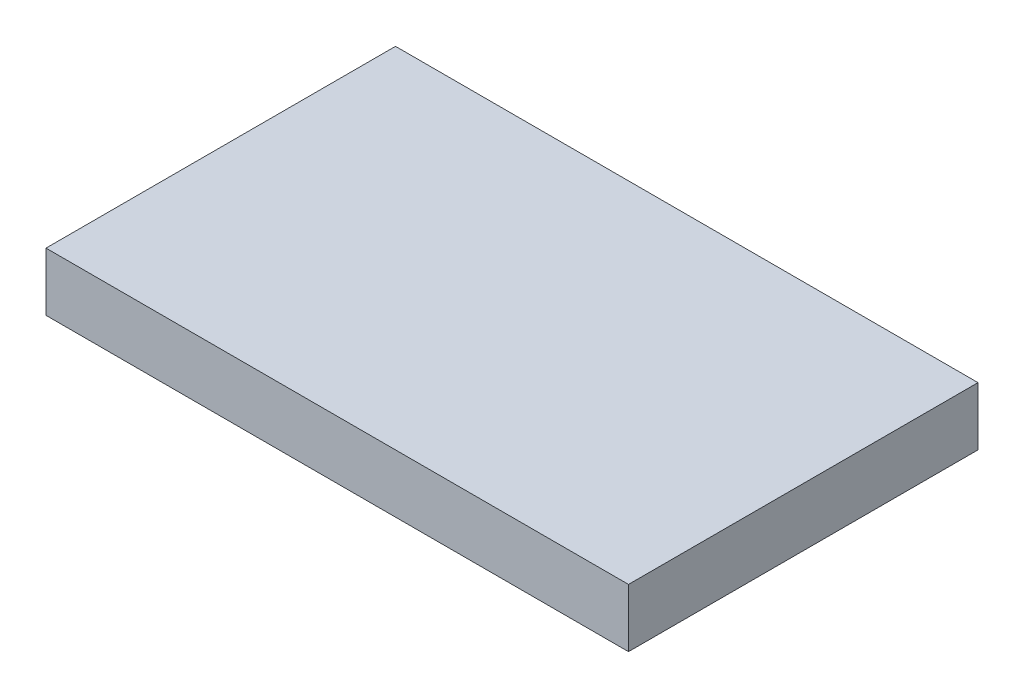
ISO-10303-21;
HEADER;
FILE_DESCRIPTION(('STEP AP214'),'2;1');
FILE_NAME('part.step','',(''),(''),'','','');
FILE_SCHEMA(('AUTOMOTIVE_DESIGN { 1 0 10303 214 1 1 1 1 }'));
ENDSEC;
DATA;
#1=APPLICATION_CONTEXT('core data for automotive mechanical design processes');
#2=APPLICATION_PROTOCOL_DEFINITION('international standard','automotive_design',2000,#1);
#3=PRODUCT_CONTEXT('',#1,'mechanical');
#4=PRODUCT('Part','Part','',(#3));
#5=PRODUCT_RELATED_PRODUCT_CATEGORY('part','',(#4));
#6=PRODUCT_DEFINITION_FORMATION('','',#4);
#7=PRODUCT_DEFINITION_CONTEXT('part definition',#1,'design');
#8=PRODUCT_DEFINITION('design','',#6,#7);
#9=PRODUCT_DEFINITION_SHAPE('','',#8);
#10=(LENGTH_UNIT() NAMED_UNIT(*) SI_UNIT(.MILLI.,.METRE.));
#11=(NAMED_UNIT(*) PLANE_ANGLE_UNIT() SI_UNIT($,.RADIAN.));
#12=(NAMED_UNIT(*) SI_UNIT($,.STERADIAN.) SOLID_ANGLE_UNIT());
#13=UNCERTAINTY_MEASURE_WITH_UNIT(LENGTH_MEASURE(1.E-05),#10,'distance_accuracy_value','');
#14=(GEOMETRIC_REPRESENTATION_CONTEXT(3) GLOBAL_UNCERTAINTY_ASSIGNED_CONTEXT((#13)) GLOBAL_UNIT_ASSIGNED_CONTEXT((#10,
#11,#12)) REPRESENTATION_CONTEXT('',''));
#15=CARTESIAN_POINT('',(0.,0.,0.));
#16=DIRECTION('',(0.,0.,1.));
#17=DIRECTION('',(1.,0.,0.));
#18=AXIS2_PLACEMENT_3D('',#15,#16,#17);
#19=CARTESIAN_POINT('',(0.,12.7,0.));
#20=DIRECTION('',(1.,0.,0.));
#21=DIRECTION('',(0.,0.,-1.));
#22=AXIS2_PLACEMENT_3D('',#19,#20,#21);
#23=PLANE('',#22);
#24=DIRECTION('',(0.,0.,1.));
#25=VECTOR('',#24,1.);
#26=CARTESIAN_POINT('',(0.,0.,0.));
#27=LINE('',#26,#25);
#28=CARTESIAN_POINT('',(0.,0.,0.));
#29=VERTEX_POINT('',#28);
#30=CARTESIAN_POINT('',(0.,0.,76.2));
#31=VERTEX_POINT('',#30);
#32=EDGE_CURVE('E98',#29,#31,#27,.T.);
#33=ORIENTED_EDGE('',*,*,#32,.T.);
#34=DIRECTION('',(0.,-1.,0.));
#35=VECTOR('',#34,1.);
#36=CARTESIAN_POINT('',(0.,12.7,76.2));
#37=LINE('',#36,#35);
#38=CARTESIAN_POINT('',(0.,12.7,76.2));
#39=VERTEX_POINT('',#38);
#40=EDGE_CURVE('E11',#39,#31,#37,.T.);
#41=ORIENTED_EDGE('',*,*,#40,.F.);
#42=DIRECTION('',(0.,0.,1.));
#43=VECTOR('',#42,1.);
#44=CARTESIAN_POINT('',(0.,12.7,0.));
#45=LINE('',#44,#43);
#46=CARTESIAN_POINT('',(0.,12.7,0.));
#47=VERTEX_POINT('',#46);
#48=EDGE_CURVE('E86',#47,#39,#45,.T.);
#49=ORIENTED_EDGE('',*,*,#48,.F.);
#50=DIRECTION('',(0.,-1.,0.));
#51=VECTOR('',#50,1.);
#52=CARTESIAN_POINT('',(0.,12.7,0.));
#53=LINE('',#52,#51);
#54=EDGE_CURVE('E94',#47,#29,#53,.T.);
#55=ORIENTED_EDGE('',*,*,#54,.T.);
#56=EDGE_LOOP('',(#33,#41,#49,#55));
#57=FACE_BOUND('',#56,.T.);
#58=ADVANCED_FACE('F35',(#57),#23,.F.);
#59=CARTESIAN_POINT('',(0.,12.7,76.2));
#60=DIRECTION('',(0.,0.,-1.));
#61=DIRECTION('',(-1.,0.,0.));
#62=AXIS2_PLACEMENT_3D('',#59,#60,#61);
#63=PLANE('',#62);
#64=DIRECTION('',(1.,0.,0.));
#65=VECTOR('',#64,1.);
#66=CARTESIAN_POINT('',(0.,0.,76.2));
#67=LINE('',#66,#65);
#68=CARTESIAN_POINT('',(127.,0.,76.2));
#69=VERTEX_POINT('',#68);
#70=EDGE_CURVE('E90',#31,#69,#67,.T.);
#71=ORIENTED_EDGE('',*,*,#70,.T.);
#72=DIRECTION('',(0.,-1.,0.));
#73=VECTOR('',#72,1.);
#74=CARTESIAN_POINT('',(127.,12.7,76.2));
#75=LINE('',#74,#73);
#76=CARTESIAN_POINT('',(127.,12.7,76.2));
#77=VERTEX_POINT('',#76);
#78=EDGE_CURVE('E43',#77,#69,#75,.T.);
#79=ORIENTED_EDGE('',*,*,#78,.F.);
#80=DIRECTION('',(1.,0.,0.));
#81=VECTOR('',#80,1.);
#82=CARTESIAN_POINT('',(0.,12.7,76.2));
#83=LINE('',#82,#81);
#84=EDGE_CURVE('E81',#39,#77,#83,.T.);
#85=ORIENTED_EDGE('',*,*,#84,.F.);
#86=ORIENTED_EDGE('',*,*,#40,.T.);
#87=EDGE_LOOP('',(#71,#79,#85,#86));
#88=FACE_BOUND('',#87,.T.);
#89=ADVANCED_FACE('F89',(#88),#63,.F.);
#90=CARTESIAN_POINT('',(127.,12.7,0.));
#91=DIRECTION('',(-1.,0.,0.));
#92=DIRECTION('',(0.,0.,1.));
#93=AXIS2_PLACEMENT_3D('',#90,#91,#92);
#94=PLANE('',#93);
#95=DIRECTION('',(0.,0.,-1.));
#96=VECTOR('',#95,1.);
#97=CARTESIAN_POINT('',(127.,0.,0.));
#98=LINE('',#97,#96);
#99=CARTESIAN_POINT('',(127.,0.,0.));
#100=VERTEX_POINT('',#99);
#101=EDGE_CURVE('E68',#69,#100,#98,.T.);
#102=ORIENTED_EDGE('',*,*,#101,.T.);
#103=DIRECTION('',(0.,-1.,0.));
#104=VECTOR('',#103,1.);
#105=CARTESIAN_POINT('',(127.,12.7,0.));
#106=LINE('',#105,#104);
#107=CARTESIAN_POINT('',(127.,12.7,0.));
#108=VERTEX_POINT('',#107);
#109=EDGE_CURVE('E91',#108,#100,#106,.T.);
#110=ORIENTED_EDGE('',*,*,#109,.F.);
#111=DIRECTION('',(0.,0.,-1.));
#112=VECTOR('',#111,1.);
#113=CARTESIAN_POINT('',(127.,12.7,0.));
#114=LINE('',#113,#112);
#115=EDGE_CURVE('E84',#77,#108,#114,.T.);
#116=ORIENTED_EDGE('',*,*,#115,.F.);
#117=ORIENTED_EDGE('',*,*,#78,.T.);
#118=EDGE_LOOP('',(#102,#110,#116,#117));
#119=FACE_BOUND('',#118,.T.);
#120=ADVANCED_FACE('F92',(#119),#94,.F.);
#121=CARTESIAN_POINT('',(0.,12.7,0.));
#122=DIRECTION('',(0.,0.,1.));
#123=DIRECTION('',(1.,0.,0.));
#124=AXIS2_PLACEMENT_3D('',#121,#122,#123);
#125=PLANE('',#124);
#126=DIRECTION('',(-1.,0.,0.));
#127=VECTOR('',#126,1.);
#128=CARTESIAN_POINT('',(0.,0.,0.));
#129=LINE('',#128,#127);
#130=EDGE_CURVE('E74',#100,#29,#129,.T.);
#131=ORIENTED_EDGE('',*,*,#130,.T.);
#132=ORIENTED_EDGE('',*,*,#54,.F.);
#133=DIRECTION('',(-1.,0.,0.));
#134=VECTOR('',#133,1.);
#135=CARTESIAN_POINT('',(0.,12.7,0.));
#136=LINE('',#135,#134);
#137=EDGE_CURVE('E51',#108,#47,#136,.T.);
#138=ORIENTED_EDGE('',*,*,#137,.F.);
#139=ORIENTED_EDGE('',*,*,#109,.T.);
#140=EDGE_LOOP('',(#131,#132,#138,#139));
#141=FACE_BOUND('',#140,.T.);
#142=ADVANCED_FACE('F105',(#141),#125,.F.);
#143=CARTESIAN_POINT('',(0.,12.7,0.));
#144=DIRECTION('',(0.,1.,0.));
#145=DIRECTION('',(0.,0.,1.));
#146=AXIS2_PLACEMENT_3D('',#143,#144,#145);
#147=PLANE('',#146);
#148=ORIENTED_EDGE('',*,*,#48,.T.);
#149=ORIENTED_EDGE('',*,*,#84,.T.);
#150=ORIENTED_EDGE('',*,*,#115,.T.);
#151=ORIENTED_EDGE('',*,*,#137,.T.);
#152=EDGE_LOOP('',(#148,#149,#150,#151));
#153=FACE_BOUND('',#152,.T.);
#154=ADVANCED_FACE('F82',(#153),#147,.T.);
#155=CARTESIAN_POINT('',(0.,0.,0.));
#156=DIRECTION('',(0.,1.,0.));
#157=DIRECTION('',(0.,0.,1.));
#158=AXIS2_PLACEMENT_3D('',#155,#156,#157);
#159=PLANE('',#158);
#160=ORIENTED_EDGE('',*,*,#32,.F.);
#161=ORIENTED_EDGE('',*,*,#130,.F.);
#162=ORIENTED_EDGE('',*,*,#101,.F.);
#163=ORIENTED_EDGE('',*,*,#70,.F.);
#164=EDGE_LOOP('',(#160,#161,#162,#163));
#165=FACE_BOUND('',#164,.T.);
#166=ADVANCED_FACE('F108',(#165),#159,.F.);
#167=CLOSED_SHELL('',(#58,#89,#120,#142,#154,#166));
#168=MANIFOLD_SOLID_BREP('B2',#167);
#169=ADVANCED_BREP_SHAPE_REPRESENTATION('',(#18,#168),#14);
#170=SHAPE_DEFINITION_REPRESENTATION(#9,#169);
ENDSEC;
END-ISO-10303-21;
